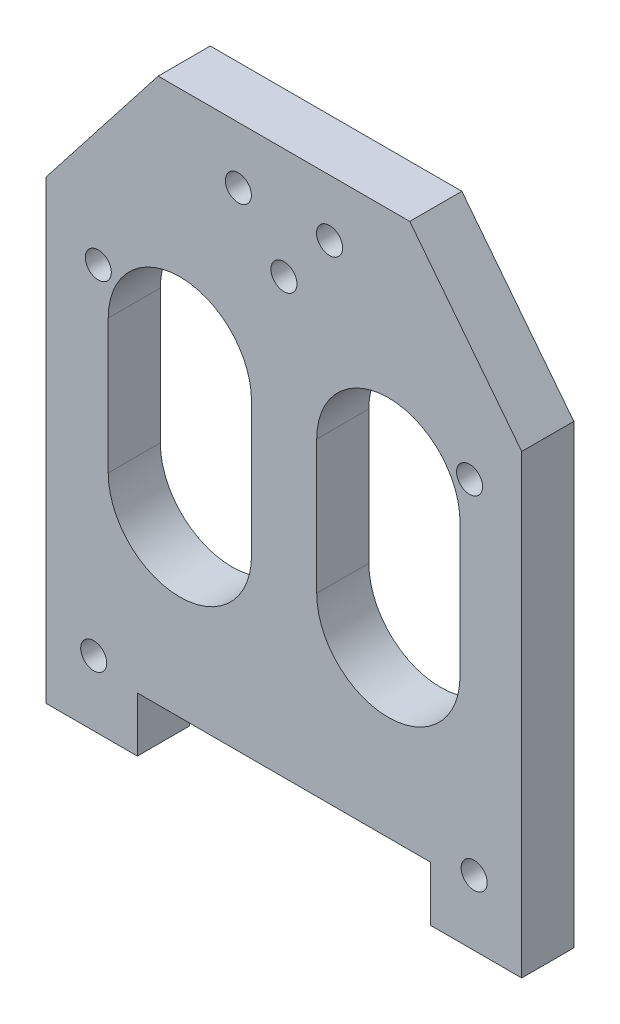
ISO-10303-21;
HEADER;
FILE_DESCRIPTION(('STEP AP214'),'2;1');
FILE_NAME('part.step','',(''),(''),'','','');
FILE_SCHEMA(('AUTOMOTIVE_DESIGN { 1 0 10303 214 1 1 1 1 }'));
ENDSEC;
DATA;
#1=APPLICATION_CONTEXT('core data for automotive mechanical design processes');
#2=APPLICATION_PROTOCOL_DEFINITION('international standard','automotive_design',2000,#1);
#3=PRODUCT_CONTEXT('',#1,'mechanical');
#4=PRODUCT('Part','Part','',(#3));
#5=PRODUCT_RELATED_PRODUCT_CATEGORY('part','',(#4));
#6=PRODUCT_DEFINITION_FORMATION('','',#4);
#7=PRODUCT_DEFINITION_CONTEXT('part definition',#1,'design');
#8=PRODUCT_DEFINITION('design','',#6,#7);
#9=PRODUCT_DEFINITION_SHAPE('','',#8);
#10=(LENGTH_UNIT() NAMED_UNIT(*) SI_UNIT(.MILLI.,.METRE.));
#11=(NAMED_UNIT(*) PLANE_ANGLE_UNIT() SI_UNIT($,.RADIAN.));
#12=(NAMED_UNIT(*) SI_UNIT($,.STERADIAN.) SOLID_ANGLE_UNIT());
#13=UNCERTAINTY_MEASURE_WITH_UNIT(LENGTH_MEASURE(1.E-05),#10,'distance_accuracy_value','');
#14=(GEOMETRIC_REPRESENTATION_CONTEXT(3) GLOBAL_UNCERTAINTY_ASSIGNED_CONTEXT((#13)) GLOBAL_UNIT_ASSIGNED_CONTEXT((#10,
#11,#12)) REPRESENTATION_CONTEXT('',''));
#15=CARTESIAN_POINT('',(0.,0.,0.));
#16=DIRECTION('',(0.,0.,1.));
#17=DIRECTION('',(1.,0.,0.));
#18=AXIS2_PLACEMENT_3D('',#15,#16,#17);
#19=CARTESIAN_POINT('',(36.5,0.,8.));
#20=DIRECTION('',(-1.,0.,0.));
#21=DIRECTION('',(0.,-1.,0.));
#22=AXIS2_PLACEMENT_3D('',#19,#20,#21);
#23=PLANE('',#22);
#24=DIRECTION('',(0.,1.,0.));
#25=VECTOR('',#24,1.);
#26=CARTESIAN_POINT('',(36.5,0.,0.));
#27=LINE('',#26,#25);
#28=CARTESIAN_POINT('',(36.5,-75.,0.));
#29=VERTEX_POINT('',#28);
#30=CARTESIAN_POINT('',(36.5,-4.99999999999991,0.));
#31=VERTEX_POINT('',#30);
#32=EDGE_CURVE('E244',#29,#31,#27,.T.);
#33=ORIENTED_EDGE('',*,*,#32,.T.);
#34=DIRECTION('',(0.,0.,-1.));
#35=VECTOR('',#34,1.);
#36=CARTESIAN_POINT('',(36.5,-4.99999999999991,8.));
#37=LINE('',#36,#35);
#38=CARTESIAN_POINT('',(36.5,-4.99999999999991,8.));
#39=VERTEX_POINT('',#38);
#40=EDGE_CURVE('E11',#39,#31,#37,.T.);
#41=ORIENTED_EDGE('',*,*,#40,.F.);
#42=DIRECTION('',(0.,1.,0.));
#43=VECTOR('',#42,1.);
#44=CARTESIAN_POINT('',(36.5,0.,8.));
#45=LINE('',#44,#43);
#46=CARTESIAN_POINT('',(36.5,-75.,8.));
#47=VERTEX_POINT('',#46);
#48=EDGE_CURVE('E406',#47,#39,#45,.T.);
#49=ORIENTED_EDGE('',*,*,#48,.F.);
#50=DIRECTION('',(0.,0.,-1.));
#51=VECTOR('',#50,1.);
#52=CARTESIAN_POINT('',(36.5,-75.,8.));
#53=LINE('',#52,#51);
#54=EDGE_CURVE('E263',#47,#29,#53,.T.);
#55=ORIENTED_EDGE('',*,*,#54,.T.);
#56=EDGE_LOOP('',(#33,#41,#49,#55));
#57=FACE_BOUND('',#56,.T.);
#58=ADVANCED_FACE('F32',(#57),#23,.F.);
#59=CARTESIAN_POINT('',(20.2393352791566,15.8127017435196,8.));
#60=DIRECTION('',(-0.788010753609288,-0.615661475322374,0.));
#61=DIRECTION('',(0.615661475322374,-0.788010753609288,0.));
#62=AXIS2_PLACEMENT_3D('',#59,#60,#61);
#63=PLANE('',#62);
#64=DIRECTION('',(-0.615661475322374,0.788010753609288,0.));
#65=VECTOR('',#64,1.);
#66=CARTESIAN_POINT('',(20.2393352791566,15.8127017435196,0.));
#67=LINE('',#66,#65);
#68=CARTESIAN_POINT('',(19.311716217,17.,0.));
#69=VERTEX_POINT('',#68);
#70=EDGE_CURVE('E247',#31,#69,#67,.T.);
#71=ORIENTED_EDGE('',*,*,#70,.T.);
#72=DIRECTION('',(0.,0.,-1.));
#73=VECTOR('',#72,1.);
#74=CARTESIAN_POINT('',(19.311716217,17.,8.));
#75=LINE('',#74,#73);
#76=CARTESIAN_POINT('',(19.311716217,17.,8.));
#77=VERTEX_POINT('',#76);
#78=EDGE_CURVE('E44',#77,#69,#75,.T.);
#79=ORIENTED_EDGE('',*,*,#78,.F.);
#80=DIRECTION('',(-0.615661475322374,0.788010753609288,0.));
#81=VECTOR('',#80,1.);
#82=CARTESIAN_POINT('',(20.2393352791566,15.8127017435196,8.));
#83=LINE('',#82,#81);
#84=EDGE_CURVE('E408',#39,#77,#83,.T.);
#85=ORIENTED_EDGE('',*,*,#84,.F.);
#86=ORIENTED_EDGE('',*,*,#40,.T.);
#87=EDGE_LOOP('',(#71,#79,#85,#86));
#88=FACE_BOUND('',#87,.T.);
#89=ADVANCED_FACE('F353',(#88),#63,.F.);
#90=CARTESIAN_POINT('',(0.,17.,8.));
#91=DIRECTION('',(0.,-1.,0.));
#92=DIRECTION('',(0.,0.,-1.));
#93=AXIS2_PLACEMENT_3D('',#90,#91,#92);
#94=PLANE('',#93);
#95=DIRECTION('',(-1.,0.,0.));
#96=VECTOR('',#95,1.);
#97=CARTESIAN_POINT('',(0.,17.,0.));
#98=LINE('',#97,#96);
#99=CARTESIAN_POINT('',(-19.311716217,17.,0.));
#100=VERTEX_POINT('',#99);
#101=EDGE_CURVE('E249',#69,#100,#98,.T.);
#102=ORIENTED_EDGE('',*,*,#101,.T.);
#103=DIRECTION('',(0.,0.,-1.));
#104=VECTOR('',#103,1.);
#105=CARTESIAN_POINT('',(-19.311716217,17.,8.));
#106=LINE('',#105,#104);
#107=CARTESIAN_POINT('',(-19.311716217,17.,8.));
#108=VERTEX_POINT('',#107);
#109=EDGE_CURVE('E277',#108,#100,#106,.T.);
#110=ORIENTED_EDGE('',*,*,#109,.F.);
#111=DIRECTION('',(-1.,0.,0.));
#112=VECTOR('',#111,1.);
#113=CARTESIAN_POINT('',(0.,17.,8.));
#114=LINE('',#113,#112);
#115=EDGE_CURVE('E410',#77,#108,#114,.T.);
#116=ORIENTED_EDGE('',*,*,#115,.F.);
#117=ORIENTED_EDGE('',*,*,#78,.T.);
#118=EDGE_LOOP('',(#102,#110,#116,#117));
#119=FACE_BOUND('',#118,.T.);
#120=ADVANCED_FACE('F359',(#119),#94,.F.);
#121=CARTESIAN_POINT('',(-20.2393352791568,15.8127017435195,8.));
#122=DIRECTION('',(0.788010753609292,-0.615661475322369,0.));
#123=DIRECTION('',(0.615661475322369,0.788010753609292,0.));
#124=AXIS2_PLACEMENT_3D('',#121,#122,#123);
#125=PLANE('',#124);
#126=DIRECTION('',(-0.615661475322369,-0.788010753609292,0.));
#127=VECTOR('',#126,1.);
#128=CARTESIAN_POINT('',(-20.2393352791568,15.8127017435195,0.));
#129=LINE('',#128,#127);
#130=CARTESIAN_POINT('',(-36.5,-5.00000000000008,0.));
#131=VERTEX_POINT('',#130);
#132=EDGE_CURVE('E251',#100,#131,#129,.T.);
#133=ORIENTED_EDGE('',*,*,#132,.T.);
#134=DIRECTION('',(0.,0.,-1.));
#135=VECTOR('',#134,1.);
#136=CARTESIAN_POINT('',(-36.5,-5.00000000000008,8.));
#137=LINE('',#136,#135);
#138=CARTESIAN_POINT('',(-36.5,-5.00000000000008,8.));
#139=VERTEX_POINT('',#138);
#140=EDGE_CURVE('E274',#139,#131,#137,.T.);
#141=ORIENTED_EDGE('',*,*,#140,.F.);
#142=DIRECTION('',(-0.615661475322369,-0.788010753609292,0.));
#143=VECTOR('',#142,1.);
#144=CARTESIAN_POINT('',(-20.2393352791568,15.8127017435195,8.));
#145=LINE('',#144,#143);
#146=EDGE_CURVE('E412',#108,#139,#145,.T.);
#147=ORIENTED_EDGE('',*,*,#146,.F.);
#148=ORIENTED_EDGE('',*,*,#109,.T.);
#149=EDGE_LOOP('',(#133,#141,#147,#148));
#150=FACE_BOUND('',#149,.T.);
#151=ADVANCED_FACE('F449',(#150),#125,.F.);
#152=CARTESIAN_POINT('',(-36.5,0.,8.));
#153=DIRECTION('',(1.,0.,0.));
#154=DIRECTION('',(0.,0.,-1.));
#155=AXIS2_PLACEMENT_3D('',#152,#153,#154);
#156=PLANE('',#155);
#157=DIRECTION('',(0.,-1.,0.));
#158=VECTOR('',#157,1.);
#159=CARTESIAN_POINT('',(-36.5,0.,0.));
#160=LINE('',#159,#158);
#161=CARTESIAN_POINT('',(-36.5,-75.,0.));
#162=VERTEX_POINT('',#161);
#163=EDGE_CURVE('E253',#131,#162,#160,.T.);
#164=ORIENTED_EDGE('',*,*,#163,.T.);
#165=DIRECTION('',(0.,0.,-1.));
#166=VECTOR('',#165,1.);
#167=CARTESIAN_POINT('',(-36.5,-75.,8.));
#168=LINE('',#167,#166);
#169=CARTESIAN_POINT('',(-36.5,-75.,8.));
#170=VERTEX_POINT('',#169);
#171=EDGE_CURVE('E271',#170,#162,#168,.T.);
#172=ORIENTED_EDGE('',*,*,#171,.F.);
#173=DIRECTION('',(0.,-1.,0.));
#174=VECTOR('',#173,1.);
#175=CARTESIAN_POINT('',(-36.5,0.,8.));
#176=LINE('',#175,#174);
#177=EDGE_CURVE('E414',#139,#170,#176,.T.);
#178=ORIENTED_EDGE('',*,*,#177,.F.);
#179=ORIENTED_EDGE('',*,*,#140,.T.);
#180=EDGE_LOOP('',(#164,#172,#178,#179));
#181=FACE_BOUND('',#180,.T.);
#182=ADVANCED_FACE('F446',(#181),#156,.F.);
#183=CARTESIAN_POINT('',(0.,-75.,8.));
#184=DIRECTION('',(0.,1.,0.));
#185=DIRECTION('',(0.,0.,1.));
#186=AXIS2_PLACEMENT_3D('',#183,#184,#185);
#187=PLANE('',#186);
#188=DIRECTION('',(1.,0.,0.));
#189=VECTOR('',#188,1.);
#190=CARTESIAN_POINT('',(0.,-75.,0.));
#191=LINE('',#190,#189);
#192=CARTESIAN_POINT('',(-22.4999999985,-75.,0.));
#193=VERTEX_POINT('',#192);
#194=EDGE_CURVE('E255',#162,#193,#191,.T.);
#195=ORIENTED_EDGE('',*,*,#194,.T.);
#196=DIRECTION('',(0.,0.,-1.));
#197=VECTOR('',#196,1.);
#198=CARTESIAN_POINT('',(-22.4999999985,-75.,8.));
#199=LINE('',#198,#197);
#200=CARTESIAN_POINT('',(-22.4999999985,-75.,8.));
#201=VERTEX_POINT('',#200);
#202=EDGE_CURVE('E268',#201,#193,#199,.T.);
#203=ORIENTED_EDGE('',*,*,#202,.F.);
#204=DIRECTION('',(1.,0.,0.));
#205=VECTOR('',#204,1.);
#206=CARTESIAN_POINT('',(0.,-75.,8.));
#207=LINE('',#206,#205);
#208=EDGE_CURVE('E416',#170,#201,#207,.T.);
#209=ORIENTED_EDGE('',*,*,#208,.F.);
#210=ORIENTED_EDGE('',*,*,#171,.T.);
#211=EDGE_LOOP('',(#195,#203,#209,#210));
#212=FACE_BOUND('',#211,.T.);
#213=ADVANCED_FACE('F422',(#212),#187,.F.);
#214=CARTESIAN_POINT('',(-22.4999999985,0.,8.));
#215=DIRECTION('',(-1.,0.,0.));
#216=DIRECTION('',(0.,0.,1.));
#217=AXIS2_PLACEMENT_3D('',#214,#215,#216);
#218=PLANE('',#217);
#219=DIRECTION('',(0.,1.,0.));
#220=VECTOR('',#219,1.);
#221=CARTESIAN_POINT('',(-22.4999999985,0.,0.));
#222=LINE('',#221,#220);
#223=CARTESIAN_POINT('',(-22.4999999985,-66.599999996,0.));
#224=VERTEX_POINT('',#223);
#225=EDGE_CURVE('E257',#193,#224,#222,.T.);
#226=ORIENTED_EDGE('',*,*,#225,.T.);
#227=DIRECTION('',(0.,0.,-1.));
#228=VECTOR('',#227,1.);
#229=CARTESIAN_POINT('',(-22.4999999985,-66.599999996,8.));
#230=LINE('',#229,#228);
#231=CARTESIAN_POINT('',(-22.4999999985,-66.599999996,8.));
#232=VERTEX_POINT('',#231);
#233=EDGE_CURVE('E186',#232,#224,#230,.T.);
#234=ORIENTED_EDGE('',*,*,#233,.F.);
#235=DIRECTION('',(0.,1.,0.));
#236=VECTOR('',#235,1.);
#237=CARTESIAN_POINT('',(-22.4999999985,0.,8.));
#238=LINE('',#237,#236);
#239=EDGE_CURVE('E177',#201,#232,#238,.T.);
#240=ORIENTED_EDGE('',*,*,#239,.F.);
#241=ORIENTED_EDGE('',*,*,#202,.T.);
#242=EDGE_LOOP('',(#226,#234,#240,#241));
#243=FACE_BOUND('',#242,.T.);
#244=ADVANCED_FACE('F426',(#243),#218,.F.);
#245=CARTESIAN_POINT('',(0.,-66.599999996,8.));
#246=DIRECTION('',(0.,1.,0.));
#247=DIRECTION('',(0.,0.,1.));
#248=AXIS2_PLACEMENT_3D('',#245,#246,#247);
#249=PLANE('',#248);
#250=DIRECTION('',(1.,0.,0.));
#251=VECTOR('',#250,1.);
#252=CARTESIAN_POINT('',(0.,-66.599999996,0.));
#253=LINE('',#252,#251);
#254=CARTESIAN_POINT('',(22.4999999985,-66.599999996,0.));
#255=VERTEX_POINT('',#254);
#256=EDGE_CURVE('E185',#224,#255,#253,.T.);
#257=ORIENTED_EDGE('',*,*,#256,.T.);
#258=DIRECTION('',(0.,0.,-1.));
#259=VECTOR('',#258,1.);
#260=CARTESIAN_POINT('',(22.4999999985,-66.599999996,8.));
#261=LINE('',#260,#259);
#262=CARTESIAN_POINT('',(22.4999999985,-66.599999996,8.));
#263=VERTEX_POINT('',#262);
#264=EDGE_CURVE('E182',#263,#255,#261,.T.);
#265=ORIENTED_EDGE('',*,*,#264,.F.);
#266=DIRECTION('',(1.,0.,0.));
#267=VECTOR('',#266,1.);
#268=CARTESIAN_POINT('',(0.,-66.599999996,8.));
#269=LINE('',#268,#267);
#270=EDGE_CURVE('E171',#232,#263,#269,.T.);
#271=ORIENTED_EDGE('',*,*,#270,.F.);
#272=ORIENTED_EDGE('',*,*,#233,.T.);
#273=EDGE_LOOP('',(#257,#265,#271,#272));
#274=FACE_BOUND('',#273,.T.);
#275=ADVANCED_FACE('F183',(#274),#249,.F.);
#276=CARTESIAN_POINT('',(22.4999999985,0.,8.));
#277=DIRECTION('',(1.,0.,0.));
#278=DIRECTION('',(0.,0.,-1.));
#279=AXIS2_PLACEMENT_3D('',#276,#277,#278);
#280=PLANE('',#279);
#281=DIRECTION('',(0.,-1.,0.));
#282=VECTOR('',#281,1.);
#283=CARTESIAN_POINT('',(22.4999999985,0.,0.));
#284=LINE('',#283,#282);
#285=CARTESIAN_POINT('',(22.4999999985,-75.,0.));
#286=VERTEX_POINT('',#285);
#287=EDGE_CURVE('E112',#255,#286,#284,.T.);
#288=ORIENTED_EDGE('',*,*,#287,.T.);
#289=DIRECTION('',(0.,0.,-1.));
#290=VECTOR('',#289,1.);
#291=CARTESIAN_POINT('',(22.4999999985,-75.,8.));
#292=LINE('',#291,#290);
#293=CARTESIAN_POINT('',(22.4999999985,-75.,8.));
#294=VERTEX_POINT('',#293);
#295=EDGE_CURVE('E187',#294,#286,#292,.T.);
#296=ORIENTED_EDGE('',*,*,#295,.F.);
#297=DIRECTION('',(0.,-1.,0.));
#298=VECTOR('',#297,1.);
#299=CARTESIAN_POINT('',(22.4999999985,0.,8.));
#300=LINE('',#299,#298);
#301=EDGE_CURVE('E175',#263,#294,#300,.T.);
#302=ORIENTED_EDGE('',*,*,#301,.F.);
#303=ORIENTED_EDGE('',*,*,#264,.T.);
#304=EDGE_LOOP('',(#288,#296,#302,#303));
#305=FACE_BOUND('',#304,.T.);
#306=ADVANCED_FACE('F189',(#305),#280,.F.);
#307=CARTESIAN_POINT('',(-15.9773726441714,-39.59107523898,8.));
#308=DIRECTION('',(0.,0.,-1.));
#309=DIRECTION('',(-1.,0.,0.));
#310=AXIS2_PLACEMENT_3D('',#307,#308,#309);
#311=CYLINDRICAL_SURFACE('',#310,10.9999941577025);
#312=CARTESIAN_POINT('',(-15.9773726441714,-39.59107523898,0.));
#313=DIRECTION('',(0.,0.,1.));
#314=DIRECTION('',(1.,0.,0.));
#315=AXIS2_PLACEMENT_3D('',#312,#313,#314);
#316=CIRCLE('',#315,10.9999941577025);
#317=CARTESIAN_POINT('',(-26.9773668018739,-39.59107523898,0.));
#318=VERTEX_POINT('',#317);
#319=CARTESIAN_POINT('',(-4.97737848646895,-39.59107523898,0.));
#320=VERTEX_POINT('',#319);
#321=EDGE_CURVE('E232',#318,#320,#316,.T.);
#322=ORIENTED_EDGE('',*,*,#321,.F.);
#323=DIRECTION('',(0.,0.,-1.));
#324=VECTOR('',#323,1.);
#325=CARTESIAN_POINT('',(-26.9773668018739,-39.59107523898,8.));
#326=LINE('',#325,#324);
#327=CARTESIAN_POINT('',(-26.9773668018739,-39.59107523898,8.));
#328=VERTEX_POINT('',#327);
#329=EDGE_CURVE('E265',#328,#318,#326,.T.);
#330=ORIENTED_EDGE('',*,*,#329,.F.);
#331=CARTESIAN_POINT('',(-15.9773726441714,-39.59107523898,8.));
#332=DIRECTION('',(0.,0.,1.));
#333=DIRECTION('',(1.,0.,0.));
#334=AXIS2_PLACEMENT_3D('',#331,#332,#333);
#335=CIRCLE('',#334,10.9999941577025);
#336=CARTESIAN_POINT('',(-4.97737848646895,-39.59107523898,8.));
#337=VERTEX_POINT('',#336);
#338=EDGE_CURVE('E396',#328,#337,#335,.T.);
#339=ORIENTED_EDGE('',*,*,#338,.T.);
#340=DIRECTION('',(0.,0.,-1.));
#341=VECTOR('',#340,1.);
#342=CARTESIAN_POINT('',(-4.97737848646895,-39.59107523898,8.));
#343=LINE('',#342,#341);
#344=EDGE_CURVE('E282',#337,#320,#343,.T.);
#345=ORIENTED_EDGE('',*,*,#344,.T.);
#346=EDGE_LOOP('',(#322,#330,#339,#345));
#347=FACE_BOUND('',#346,.T.);
#348=ADVANCED_FACE('F372',(#347),#311,.F.);
#349=CARTESIAN_POINT('',(-26.9773912037194,-1.66274445938005E-05,8.));
#350=DIRECTION('',(0.99999999999981,6.16347387641578E-07,0.));
#351=DIRECTION('',(-6.16347387641578E-07,0.99999999999981,0.));
#352=AXIS2_PLACEMENT_3D('',#349,#350,#351);
#353=PLANE('',#352);
#354=DIRECTION('',(6.16347387641578E-07,-0.99999999999981,0.));
#355=VECTOR('',#354,1.);
#356=CARTESIAN_POINT('',(-26.9773912037194,-1.66274445938005E-05,0.));
#357=LINE('',#356,#355);
#358=CARTESIAN_POINT('',(-26.9773794871606,-19.0096841131543,0.));
#359=VERTEX_POINT('',#358);
#360=EDGE_CURVE('E235',#359,#318,#357,.T.);
#361=ORIENTED_EDGE('',*,*,#360,.F.);
#362=DIRECTION('',(0.,0.,-1.));
#363=VECTOR('',#362,1.);
#364=CARTESIAN_POINT('',(-26.9773794871606,-19.0096841131543,8.));
#365=LINE('',#364,#363);
#366=CARTESIAN_POINT('',(-26.9773794871606,-19.0096841131543,8.));
#367=VERTEX_POINT('',#366);
#368=EDGE_CURVE('E286',#367,#359,#365,.T.);
#369=ORIENTED_EDGE('',*,*,#368,.F.);
#370=DIRECTION('',(6.16347387641578E-07,-0.99999999999981,0.));
#371=VECTOR('',#370,1.);
#372=CARTESIAN_POINT('',(-26.9773912037194,-1.66274445938005E-05,8.));
#373=LINE('',#372,#371);
#374=EDGE_CURVE('E391',#367,#328,#373,.T.);
#375=ORIENTED_EDGE('',*,*,#374,.T.);
#376=ORIENTED_EDGE('',*,*,#329,.T.);
#377=EDGE_LOOP('',(#361,#369,#375,#376));
#378=FACE_BOUND('',#377,.T.);
#379=ADVANCED_FACE('F369',(#378),#353,.T.);
#380=CARTESIAN_POINT('',(-15.9773853294581,-19.0096841131543,8.));
#381=DIRECTION('',(0.,0.,-1.));
#382=DIRECTION('',(-1.,0.,0.));
#383=AXIS2_PLACEMENT_3D('',#380,#381,#382);
#384=CYLINDRICAL_SURFACE('',#383,10.9999941577025);
#385=CARTESIAN_POINT('',(-15.9773853294581,-19.0096841131543,0.));
#386=DIRECTION('',(0.,0.,1.));
#387=DIRECTION('',(1.,0.,0.));
#388=AXIS2_PLACEMENT_3D('',#385,#386,#387);
#389=CIRCLE('',#388,10.9999941577025);
#390=CARTESIAN_POINT('',(-4.97739117175564,-19.0096841131543,0.));
#391=VERTEX_POINT('',#390);
#392=EDGE_CURVE('E238',#391,#359,#389,.T.);
#393=ORIENTED_EDGE('',*,*,#392,.F.);
#394=DIRECTION('',(0.,0.,-1.));
#395=VECTOR('',#394,1.);
#396=CARTESIAN_POINT('',(-4.97739117175564,-19.0096841131543,8.));
#397=LINE('',#396,#395);
#398=CARTESIAN_POINT('',(-4.97739117175564,-19.0096841131543,8.));
#399=VERTEX_POINT('',#398);
#400=EDGE_CURVE('E284',#399,#391,#397,.T.);
#401=ORIENTED_EDGE('',*,*,#400,.F.);
#402=CARTESIAN_POINT('',(-15.9773853294581,-19.0096841131543,8.));
#403=DIRECTION('',(0.,0.,1.));
#404=DIRECTION('',(1.,0.,0.));
#405=AXIS2_PLACEMENT_3D('',#402,#403,#404);
#406=CIRCLE('',#405,10.9999941577025);
#407=EDGE_CURVE('E395',#399,#367,#406,.T.);
#408=ORIENTED_EDGE('',*,*,#407,.T.);
#409=ORIENTED_EDGE('',*,*,#368,.T.);
#410=EDGE_LOOP('',(#393,#401,#408,#409));
#411=FACE_BOUND('',#410,.T.);
#412=ADVANCED_FACE('F322',(#411),#384,.F.);
#413=CARTESIAN_POINT('',(16.0301881892566,-39.59107523898,8.));
#414=DIRECTION('',(0.,0.,-1.));
#415=DIRECTION('',(-1.,0.,0.));
#416=AXIS2_PLACEMENT_3D('',#413,#414,#415);
#417=CYLINDRICAL_SURFACE('',#416,10.9999943945777);
#418=CARTESIAN_POINT('',(16.0301881892566,-39.59107523898,0.));
#419=DIRECTION('',(0.,0.,1.));
#420=DIRECTION('',(1.,0.,0.));
#421=AXIS2_PLACEMENT_3D('',#418,#419,#420);
#422=CIRCLE('',#421,10.9999943945777);
#423=CARTESIAN_POINT('',(5.03019379467892,-39.59107523898,0.));
#424=VERTEX_POINT('',#423);
#425=CARTESIAN_POINT('',(27.0301825838343,-39.59107523898,0.));
#426=VERTEX_POINT('',#425);
#427=EDGE_CURVE('E216',#424,#426,#422,.T.);
#428=ORIENTED_EDGE('',*,*,#427,.F.);
#429=DIRECTION('',(0.,0.,-1.));
#430=VECTOR('',#429,1.);
#431=CARTESIAN_POINT('',(5.03019379467892,-39.59107523898,8.));
#432=LINE('',#431,#430);
#433=CARTESIAN_POINT('',(5.03019379467892,-39.59107523898,8.));
#434=VERTEX_POINT('',#433);
#435=EDGE_CURVE('E126',#434,#424,#432,.T.);
#436=ORIENTED_EDGE('',*,*,#435,.F.);
#437=CARTESIAN_POINT('',(16.0301881892566,-39.59107523898,8.));
#438=DIRECTION('',(0.,0.,1.));
#439=DIRECTION('',(1.,0.,0.));
#440=AXIS2_PLACEMENT_3D('',#437,#438,#439);
#441=CIRCLE('',#440,10.9999943945777);
#442=CARTESIAN_POINT('',(27.0301825838343,-39.59107523898,8.));
#443=VERTEX_POINT('',#442);
#444=EDGE_CURVE('E616',#434,#443,#441,.T.);
#445=ORIENTED_EDGE('',*,*,#444,.T.);
#446=DIRECTION('',(0.,0.,-1.));
#447=VECTOR('',#446,1.);
#448=CARTESIAN_POINT('',(27.0301825838343,-39.59107523898,8.));
#449=LINE('',#448,#447);
#450=EDGE_CURVE('E191',#443,#426,#449,.T.);
#451=ORIENTED_EDGE('',*,*,#450,.T.);
#452=EDGE_LOOP('',(#428,#436,#445,#451));
#453=FACE_BOUND('',#452,.T.);
#454=ADVANCED_FACE('F318',(#453),#417,.F.);
#455=CARTESIAN_POINT('',(5.03016912422898,3.13445707156947E-06,8.));
#456=DIRECTION('',(0.999999999999806,6.23131547699067E-07,0.));
#457=DIRECTION('',(-6.23131547699067E-07,0.999999999999806,0.));
#458=AXIS2_PLACEMENT_3D('',#455,#456,#457);
#459=PLANE('',#458);
#460=DIRECTION('',(6.23131547699067E-07,-0.999999999999806,0.));
#461=VECTOR('',#460,1.);
#462=CARTESIAN_POINT('',(5.03016912422898,3.13445707156947E-06,0.));
#463=LINE('',#462,#461);
#464=CARTESIAN_POINT('',(5.0301810182636,-19.0875148493323,0.));
#465=VERTEX_POINT('',#464);
#466=EDGE_CURVE('E219',#465,#424,#463,.T.);
#467=ORIENTED_EDGE('',*,*,#466,.F.);
#468=CARTESIAN_POINT('',(5.03018101826146,-19.0875148493323,8.));
#469=DIRECTION('',(0.,0.,-1.));
#470=VECTOR('',#469,1.);
#471=LINE('',#468,#470);
#472=CARTESIAN_POINT('',(5.0301810182636,-19.0875148493323,8.));
#473=VERTEX_POINT('',#472);
#474=EDGE_CURVE('E292',#473,#465,#471,.T.);
#475=ORIENTED_EDGE('',*,*,#474,.F.);
#476=DIRECTION('',(6.23131547699067E-07,-0.999999999999806,0.));
#477=VECTOR('',#476,1.);
#478=CARTESIAN_POINT('',(5.03016912422898,3.13445707156947E-06,8.));
#479=LINE('',#478,#477);
#480=EDGE_CURVE('E622',#473,#434,#479,.T.);
#481=ORIENTED_EDGE('',*,*,#480,.T.);
#482=ORIENTED_EDGE('',*,*,#435,.T.);
#483=EDGE_LOOP('',(#467,#475,#481,#482));
#484=FACE_BOUND('',#483,.T.);
#485=ADVANCED_FACE('F312',(#484),#459,.T.);
#486=CARTESIAN_POINT('',(16.030175412837,-19.0875079940277,8.));
#487=DIRECTION('',(0.,0.,-1.));
#488=DIRECTION('',(-1.,0.,0.));
#489=AXIS2_PLACEMENT_3D('',#486,#487,#488);
#490=CYLINDRICAL_SURFACE('',#489,10.9999943945777);
#491=CARTESIAN_POINT('',(16.030175412837,-19.0875079940277,0.));
#492=DIRECTION('',(0.,0.,1.));
#493=DIRECTION('',(1.,0.,0.));
#494=AXIS2_PLACEMENT_3D('',#491,#492,#493);
#495=CIRCLE('',#494,10.9999943945777);
#496=CARTESIAN_POINT('',(27.0301698074147,-19.0875079940277,0.));
#497=VERTEX_POINT('',#496);
#498=EDGE_CURVE('E222',#497,#465,#495,.T.);
#499=ORIENTED_EDGE('',*,*,#498,.F.);
#500=DIRECTION('',(0.,0.,-1.));
#501=VECTOR('',#500,1.);
#502=CARTESIAN_POINT('',(27.0301698074147,-19.0875079940277,8.));
#503=LINE('',#502,#501);
#504=CARTESIAN_POINT('',(27.0301698074147,-19.0875079940277,8.));
#505=VERTEX_POINT('',#504);
#506=EDGE_CURVE('E290',#505,#497,#503,.T.);
#507=ORIENTED_EDGE('',*,*,#506,.F.);
#508=CARTESIAN_POINT('',(16.030175412837,-19.0875079940277,8.));
#509=DIRECTION('',(0.,0.,1.));
#510=DIRECTION('',(1.,0.,0.));
#511=AXIS2_PLACEMENT_3D('',#508,#509,#510);
#512=CIRCLE('',#511,10.9999943945777);
#513=EDGE_CURVE('E619',#505,#473,#512,.T.);
#514=ORIENTED_EDGE('',*,*,#513,.T.);
#515=ORIENTED_EDGE('',*,*,#474,.T.);
#516=EDGE_LOOP('',(#499,#507,#514,#515));
#517=FACE_BOUND('',#516,.T.);
#518=ADVANCED_FACE('F302',(#517),#490,.F.);
#519=CARTESIAN_POINT('',(-4.97740288832291,-3.06780927417046E-06,8.));
#520=DIRECTION('',(-0.99999999999981,-6.16347388990155E-07,0.));
#521=DIRECTION('',(6.16347388990155E-07,-0.99999999999981,0.));
#522=AXIS2_PLACEMENT_3D('',#519,#520,#521);
#523=PLANE('',#522);
#524=DIRECTION('',(-6.16347388990155E-07,0.99999999999981,0.));
#525=VECTOR('',#524,1.);
#526=CARTESIAN_POINT('',(-4.97740288832291,-3.06780927417046E-06,0.));
#527=LINE('',#526,#525);
#528=EDGE_CURVE('E241',#320,#391,#527,.T.);
#529=ORIENTED_EDGE('',*,*,#528,.F.);
#530=ORIENTED_EDGE('',*,*,#344,.F.);
#531=DIRECTION('',(-6.16347388990155E-07,0.99999999999981,0.));
#532=VECTOR('',#531,1.);
#533=CARTESIAN_POINT('',(-4.97740288832291,-3.06780927417046E-06,8.));
#534=LINE('',#533,#532);
#535=EDGE_CURVE('E398',#337,#399,#534,.T.);
#536=ORIENTED_EDGE('',*,*,#535,.T.);
#537=ORIENTED_EDGE('',*,*,#400,.T.);
#538=EDGE_LOOP('',(#529,#530,#536,#537));
#539=FACE_BOUND('',#538,.T.);
#540=ADVANCED_FACE('F311',(#539),#523,.T.);
#541=CARTESIAN_POINT('',(27.0301579133758,1.6843344169419E-05,8.));
#542=DIRECTION('',(0.999999999999806,6.23131548968156E-07,0.));
#543=DIRECTION('',(-6.23131548968156E-07,0.999999999999806,0.));
#544=AXIS2_PLACEMENT_3D('',#541,#542,#543);
#545=PLANE('',#544);
#546=DIRECTION('',(6.23131548968156E-07,-0.999999999999806,0.));
#547=VECTOR('',#546,1.);
#548=CARTESIAN_POINT('',(27.0301579133758,1.6843344169419E-05,0.));
#549=LINE('',#548,#547);
#550=EDGE_CURVE('E227',#497,#426,#549,.T.);
#551=ORIENTED_EDGE('',*,*,#550,.T.);
#552=ORIENTED_EDGE('',*,*,#450,.F.);
#553=DIRECTION('',(6.23131548968156E-07,-0.999999999999806,0.));
#554=VECTOR('',#553,1.);
#555=CARTESIAN_POINT('',(27.0301579133758,1.6843344169419E-05,8.));
#556=LINE('',#555,#554);
#557=EDGE_CURVE('E400',#505,#443,#556,.T.);
#558=ORIENTED_EDGE('',*,*,#557,.F.);
#559=ORIENTED_EDGE('',*,*,#506,.T.);
#560=EDGE_LOOP('',(#551,#552,#558,#559));
#561=FACE_BOUND('',#560,.T.);
#562=ADVANCED_FACE('F313',(#561),#545,.F.);
#563=CARTESIAN_POINT('',(0.,0.,8.));
#564=DIRECTION('',(0.,0.,-1.));
#565=DIRECTION('',(-1.,0.,0.));
#566=AXIS2_PLACEMENT_3D('',#563,#564,#565);
#567=CYLINDRICAL_SURFACE('',#566,1.99999999999999);
#568=CARTESIAN_POINT('',(0.,0.,8.));
#569=DIRECTION('',(0.,0.,1.));
#570=DIRECTION('',(1.,0.,0.));
#571=AXIS2_PLACEMENT_3D('',#568,#569,#570);
#572=CIRCLE('',#571,1.99999999999999);
#573=CARTESIAN_POINT('',(1.99999999999999,0.,8.));
#574=VERTEX_POINT('',#573);
#575=EDGE_CURVE('E632',#574,#574,#572,.T.);
#576=ORIENTED_EDGE('',*,*,#575,.T.);
#577=EDGE_LOOP('',(#576));
#578=FACE_BOUND('',#577,.T.);
#579=CARTESIAN_POINT('',(0.,0.,0.));
#580=DIRECTION('',(0.,0.,1.));
#581=DIRECTION('',(1.,0.,0.));
#582=AXIS2_PLACEMENT_3D('',#579,#580,#581);
#583=CIRCLE('',#582,1.99999999999999);
#584=CARTESIAN_POINT('',(1.99999999999999,0.,0.));
#585=VERTEX_POINT('',#584);
#586=EDGE_CURVE('E213',#585,#585,#583,.T.);
#587=ORIENTED_EDGE('',*,*,#586,.F.);
#588=EDGE_LOOP('',(#587));
#589=FACE_BOUND('',#588,.T.);
#590=ADVANCED_FACE('F323',(#578,#589),#567,.F.);
#591=CARTESIAN_POINT('',(-7.,8.3,8.));
#592=DIRECTION('',(0.,0.,-1.));
#593=DIRECTION('',(-1.,0.,0.));
#594=AXIS2_PLACEMENT_3D('',#591,#592,#593);
#595=CYLINDRICAL_SURFACE('',#594,1.99999999999999);
#596=CARTESIAN_POINT('',(-7.,8.3,8.));
#597=DIRECTION('',(0.,0.,1.));
#598=DIRECTION('',(1.,0.,0.));
#599=AXIS2_PLACEMENT_3D('',#596,#597,#598);
#600=CIRCLE('',#599,1.99999999999999);
#601=CARTESIAN_POINT('',(-5.00000000000001,8.3,8.));
#602=VERTEX_POINT('',#601);
#603=EDGE_CURVE('E635',#602,#602,#600,.T.);
#604=ORIENTED_EDGE('',*,*,#603,.T.);
#605=EDGE_LOOP('',(#604));
#606=FACE_BOUND('',#605,.T.);
#607=CARTESIAN_POINT('',(-7.,8.3,0.));
#608=DIRECTION('',(0.,0.,1.));
#609=DIRECTION('',(1.,0.,0.));
#610=AXIS2_PLACEMENT_3D('',#607,#608,#609);
#611=CIRCLE('',#610,1.99999999999999);
#612=CARTESIAN_POINT('',(-5.00000000000001,8.3,0.));
#613=VERTEX_POINT('',#612);
#614=EDGE_CURVE('E210',#613,#613,#611,.T.);
#615=ORIENTED_EDGE('',*,*,#614,.F.);
#616=EDGE_LOOP('',(#615));
#617=FACE_BOUND('',#616,.T.);
#618=ADVANCED_FACE('F326',(#606,#617),#595,.F.);
#619=CARTESIAN_POINT('',(7.,8.3,8.));
#620=DIRECTION('',(0.,0.,-1.));
#621=DIRECTION('',(-1.,0.,0.));
#622=AXIS2_PLACEMENT_3D('',#619,#620,#621);
#623=CYLINDRICAL_SURFACE('',#622,1.99999999999999);
#624=CARTESIAN_POINT('',(7.,8.3,8.));
#625=DIRECTION('',(0.,0.,1.));
#626=DIRECTION('',(1.,0.,0.));
#627=AXIS2_PLACEMENT_3D('',#624,#625,#626);
#628=CIRCLE('',#627,1.99999999999999);
#629=CARTESIAN_POINT('',(8.99999999999999,8.3,8.));
#630=VERTEX_POINT('',#629);
#631=EDGE_CURVE('E638',#630,#630,#628,.T.);
#632=ORIENTED_EDGE('',*,*,#631,.T.);
#633=EDGE_LOOP('',(#632));
#634=FACE_BOUND('',#633,.T.);
#635=CARTESIAN_POINT('',(7.,8.3,0.));
#636=DIRECTION('',(0.,0.,1.));
#637=DIRECTION('',(1.,0.,0.));
#638=AXIS2_PLACEMENT_3D('',#635,#636,#637);
#639=CIRCLE('',#638,1.99999999999999);
#640=CARTESIAN_POINT('',(8.99999999999999,8.3,0.));
#641=VERTEX_POINT('',#640);
#642=EDGE_CURVE('E207',#641,#641,#639,.T.);
#643=ORIENTED_EDGE('',*,*,#642,.F.);
#644=EDGE_LOOP('',(#643));
#645=FACE_BOUND('',#644,.T.);
#646=ADVANCED_FACE('F330',(#634,#645),#623,.F.);
#647=CARTESIAN_POINT('',(-28.5,-12.7,8.));
#648=DIRECTION('',(0.,0.,-1.));
#649=DIRECTION('',(-1.,0.,0.));
#650=AXIS2_PLACEMENT_3D('',#647,#648,#649);
#651=CYLINDRICAL_SURFACE('',#650,1.99999999999998);
#652=CARTESIAN_POINT('',(-28.5,-12.7,8.));
#653=DIRECTION('',(0.,0.,1.));
#654=DIRECTION('',(1.,0.,0.));
#655=AXIS2_PLACEMENT_3D('',#652,#653,#654);
#656=CIRCLE('',#655,1.99999999999998);
#657=CARTESIAN_POINT('',(-26.5,-12.7,8.));
#658=VERTEX_POINT('',#657);
#659=EDGE_CURVE('E641',#658,#658,#656,.T.);
#660=ORIENTED_EDGE('',*,*,#659,.T.);
#661=EDGE_LOOP('',(#660));
#662=FACE_BOUND('',#661,.T.);
#663=CARTESIAN_POINT('',(-28.5,-12.7,0.));
#664=DIRECTION('',(0.,0.,1.));
#665=DIRECTION('',(1.,0.,0.));
#666=AXIS2_PLACEMENT_3D('',#663,#664,#665);
#667=CIRCLE('',#666,1.99999999999998);
#668=CARTESIAN_POINT('',(-26.5,-12.7,0.));
#669=VERTEX_POINT('',#668);
#670=EDGE_CURVE('E204',#669,#669,#667,.T.);
#671=ORIENTED_EDGE('',*,*,#670,.F.);
#672=EDGE_LOOP('',(#671));
#673=FACE_BOUND('',#672,.T.);
#674=ADVANCED_FACE('F334',(#662,#673),#651,.F.);
#675=CARTESIAN_POINT('',(-29.2,-65.,8.));
#676=DIRECTION('',(0.,0.,-1.));
#677=DIRECTION('',(-1.,0.,0.));
#678=AXIS2_PLACEMENT_3D('',#675,#676,#677);
#679=CYLINDRICAL_SURFACE('',#678,1.99999999999998);
#680=CARTESIAN_POINT('',(-29.2,-65.,8.));
#681=DIRECTION('',(0.,0.,1.));
#682=DIRECTION('',(1.,0.,0.));
#683=AXIS2_PLACEMENT_3D('',#680,#681,#682);
#684=CIRCLE('',#683,1.99999999999998);
#685=CARTESIAN_POINT('',(-27.2,-65.,8.));
#686=VERTEX_POINT('',#685);
#687=EDGE_CURVE('E644',#686,#686,#684,.T.);
#688=ORIENTED_EDGE('',*,*,#687,.T.);
#689=EDGE_LOOP('',(#688));
#690=FACE_BOUND('',#689,.T.);
#691=CARTESIAN_POINT('',(-29.2,-65.,0.));
#692=DIRECTION('',(0.,0.,1.));
#693=DIRECTION('',(1.,0.,0.));
#694=AXIS2_PLACEMENT_3D('',#691,#692,#693);
#695=CIRCLE('',#694,1.99999999999998);
#696=CARTESIAN_POINT('',(-27.2,-65.,0.));
#697=VERTEX_POINT('',#696);
#698=EDGE_CURVE('E201',#697,#697,#695,.T.);
#699=ORIENTED_EDGE('',*,*,#698,.F.);
#700=EDGE_LOOP('',(#699));
#701=FACE_BOUND('',#700,.T.);
#702=ADVANCED_FACE('F338',(#690,#701),#679,.F.);
#703=CARTESIAN_POINT('',(29.2,-65.,8.));
#704=DIRECTION('',(0.,0.,-1.));
#705=DIRECTION('',(-1.,0.,0.));
#706=AXIS2_PLACEMENT_3D('',#703,#704,#705);
#707=CYLINDRICAL_SURFACE('',#706,1.99999999999998);
#708=CARTESIAN_POINT('',(29.2,-65.,8.));
#709=DIRECTION('',(0.,0.,1.));
#710=DIRECTION('',(1.,0.,0.));
#711=AXIS2_PLACEMENT_3D('',#708,#709,#710);
#712=CIRCLE('',#711,1.99999999999998);
#713=CARTESIAN_POINT('',(31.2,-65.,8.));
#714=VERTEX_POINT('',#713);
#715=EDGE_CURVE('E647',#714,#714,#712,.T.);
#716=ORIENTED_EDGE('',*,*,#715,.T.);
#717=EDGE_LOOP('',(#716));
#718=FACE_BOUND('',#717,.T.);
#719=CARTESIAN_POINT('',(29.2,-65.,0.));
#720=DIRECTION('',(0.,0.,1.));
#721=DIRECTION('',(1.,0.,0.));
#722=AXIS2_PLACEMENT_3D('',#719,#720,#721);
#723=CIRCLE('',#722,1.99999999999998);
#724=CARTESIAN_POINT('',(31.2,-65.,0.));
#725=VERTEX_POINT('',#724);
#726=EDGE_CURVE('E198',#725,#725,#723,.T.);
#727=ORIENTED_EDGE('',*,*,#726,.F.);
#728=EDGE_LOOP('',(#727));
#729=FACE_BOUND('',#728,.T.);
#730=ADVANCED_FACE('F341',(#718,#729),#707,.F.);
#731=CARTESIAN_POINT('',(28.5,-12.7,8.));
#732=DIRECTION('',(0.,0.,-1.));
#733=DIRECTION('',(-1.,0.,0.));
#734=AXIS2_PLACEMENT_3D('',#731,#732,#733);
#735=CYLINDRICAL_SURFACE('',#734,1.99999999999999);
#736=CARTESIAN_POINT('',(28.5,-12.7,8.));
#737=DIRECTION('',(0.,0.,1.));
#738=DIRECTION('',(1.,0.,0.));
#739=AXIS2_PLACEMENT_3D('',#736,#737,#738);
#740=CIRCLE('',#739,1.99999999999999);
#741=CARTESIAN_POINT('',(30.5,-12.7,8.));
#742=VERTEX_POINT('',#741);
#743=EDGE_CURVE('E262',#742,#742,#740,.T.);
#744=ORIENTED_EDGE('',*,*,#743,.T.);
#745=EDGE_LOOP('',(#744));
#746=FACE_BOUND('',#745,.T.);
#747=CARTESIAN_POINT('',(28.5,-12.7,0.));
#748=DIRECTION('',(0.,0.,1.));
#749=DIRECTION('',(1.,0.,0.));
#750=AXIS2_PLACEMENT_3D('',#747,#748,#749);
#751=CIRCLE('',#750,1.99999999999999);
#752=CARTESIAN_POINT('',(30.5,-12.7,0.));
#753=VERTEX_POINT('',#752);
#754=EDGE_CURVE('E195',#753,#753,#751,.T.);
#755=ORIENTED_EDGE('',*,*,#754,.F.);
#756=EDGE_LOOP('',(#755));
#757=FACE_BOUND('',#756,.T.);
#758=ADVANCED_FACE('F34',(#746,#757),#735,.F.);
#759=CARTESIAN_POINT('',(0.,-75.,8.));
#760=DIRECTION('',(0.,1.,0.));
#761=DIRECTION('',(0.,0.,1.));
#762=AXIS2_PLACEMENT_3D('',#759,#760,#761);
#763=PLANE('',#762);
#764=DIRECTION('',(1.,0.,0.));
#765=VECTOR('',#764,1.);
#766=CARTESIAN_POINT('',(0.,-75.,0.));
#767=LINE('',#766,#765);
#768=EDGE_CURVE('E118',#286,#29,#767,.T.);
#769=ORIENTED_EDGE('',*,*,#768,.T.);
#770=ORIENTED_EDGE('',*,*,#54,.F.);
#771=DIRECTION('',(1.,0.,0.));
#772=VECTOR('',#771,1.);
#773=CARTESIAN_POINT('',(0.,-75.,8.));
#774=LINE('',#773,#772);
#775=EDGE_CURVE('E53',#294,#47,#774,.T.);
#776=ORIENTED_EDGE('',*,*,#775,.F.);
#777=ORIENTED_EDGE('',*,*,#295,.T.);
#778=EDGE_LOOP('',(#769,#770,#776,#777));
#779=FACE_BOUND('',#778,.T.);
#780=ADVANCED_FACE('F348',(#779),#763,.F.);
#781=CARTESIAN_POINT('',(0.,0.,8.));
#782=DIRECTION('',(0.,0.,1.));
#783=DIRECTION('',(1.,0.,0.));
#784=AXIS2_PLACEMENT_3D('',#781,#782,#783);
#785=PLANE('',#784);
#786=ORIENTED_EDGE('',*,*,#743,.F.);
#787=EDGE_LOOP('',(#786));
#788=FACE_BOUND('',#787,.T.);
#789=ORIENTED_EDGE('',*,*,#715,.F.);
#790=EDGE_LOOP('',(#789));
#791=FACE_BOUND('',#790,.T.);
#792=ORIENTED_EDGE('',*,*,#687,.F.);
#793=EDGE_LOOP('',(#792));
#794=FACE_BOUND('',#793,.T.);
#795=ORIENTED_EDGE('',*,*,#659,.F.);
#796=EDGE_LOOP('',(#795));
#797=FACE_BOUND('',#796,.T.);
#798=ORIENTED_EDGE('',*,*,#631,.F.);
#799=EDGE_LOOP('',(#798));
#800=FACE_BOUND('',#799,.T.);
#801=ORIENTED_EDGE('',*,*,#603,.F.);
#802=EDGE_LOOP('',(#801));
#803=FACE_BOUND('',#802,.T.);
#804=ORIENTED_EDGE('',*,*,#575,.F.);
#805=EDGE_LOOP('',(#804));
#806=FACE_BOUND('',#805,.T.);
#807=ORIENTED_EDGE('',*,*,#444,.F.);
#808=ORIENTED_EDGE('',*,*,#480,.F.);
#809=ORIENTED_EDGE('',*,*,#513,.F.);
#810=ORIENTED_EDGE('',*,*,#557,.T.);
#811=EDGE_LOOP('',(#807,#808,#809,#810));
#812=FACE_BOUND('',#811,.T.);
#813=ORIENTED_EDGE('',*,*,#338,.F.);
#814=ORIENTED_EDGE('',*,*,#374,.F.);
#815=ORIENTED_EDGE('',*,*,#407,.F.);
#816=ORIENTED_EDGE('',*,*,#535,.F.);
#817=EDGE_LOOP('',(#813,#814,#815,#816));
#818=FACE_BOUND('',#817,.T.);
#819=ORIENTED_EDGE('',*,*,#48,.T.);
#820=ORIENTED_EDGE('',*,*,#84,.T.);
#821=ORIENTED_EDGE('',*,*,#115,.T.);
#822=ORIENTED_EDGE('',*,*,#146,.T.);
#823=ORIENTED_EDGE('',*,*,#177,.T.);
#824=ORIENTED_EDGE('',*,*,#208,.T.);
#825=ORIENTED_EDGE('',*,*,#239,.T.);
#826=ORIENTED_EDGE('',*,*,#270,.T.);
#827=ORIENTED_EDGE('',*,*,#301,.T.);
#828=ORIENTED_EDGE('',*,*,#775,.T.);
#829=EDGE_LOOP('',(#819,#820,#821,#822,#823,#824,#825,#826,#827,#828));
#830=FACE_BOUND('',#829,.T.);
#831=ADVANCED_FACE('F173',(#788,#791,#794,#797,#800,#803,#806,#812,#818,#830),#785,.T.);
#832=CARTESIAN_POINT('',(0.,0.,0.));
#833=DIRECTION('',(0.,0.,1.));
#834=DIRECTION('',(1.,0.,0.));
#835=AXIS2_PLACEMENT_3D('',#832,#833,#834);
#836=PLANE('',#835);
#837=ORIENTED_EDGE('',*,*,#754,.T.);
#838=EDGE_LOOP('',(#837));
#839=FACE_BOUND('',#838,.T.);
#840=ORIENTED_EDGE('',*,*,#726,.T.);
#841=EDGE_LOOP('',(#840));
#842=FACE_BOUND('',#841,.T.);
#843=ORIENTED_EDGE('',*,*,#698,.T.);
#844=EDGE_LOOP('',(#843));
#845=FACE_BOUND('',#844,.T.);
#846=ORIENTED_EDGE('',*,*,#670,.T.);
#847=EDGE_LOOP('',(#846));
#848=FACE_BOUND('',#847,.T.);
#849=ORIENTED_EDGE('',*,*,#642,.T.);
#850=EDGE_LOOP('',(#849));
#851=FACE_BOUND('',#850,.T.);
#852=ORIENTED_EDGE('',*,*,#614,.T.);
#853=EDGE_LOOP('',(#852));
#854=FACE_BOUND('',#853,.T.);
#855=ORIENTED_EDGE('',*,*,#586,.T.);
#856=EDGE_LOOP('',(#855));
#857=FACE_BOUND('',#856,.T.);
#858=ORIENTED_EDGE('',*,*,#427,.T.);
#859=ORIENTED_EDGE('',*,*,#550,.F.);
#860=ORIENTED_EDGE('',*,*,#498,.T.);
#861=ORIENTED_EDGE('',*,*,#466,.T.);
#862=EDGE_LOOP('',(#858,#859,#860,#861));
#863=FACE_BOUND('',#862,.T.);
#864=ORIENTED_EDGE('',*,*,#321,.T.);
#865=ORIENTED_EDGE('',*,*,#528,.T.);
#866=ORIENTED_EDGE('',*,*,#392,.T.);
#867=ORIENTED_EDGE('',*,*,#360,.T.);
#868=EDGE_LOOP('',(#864,#865,#866,#867));
#869=FACE_BOUND('',#868,.T.);
#870=ORIENTED_EDGE('',*,*,#32,.F.);
#871=ORIENTED_EDGE('',*,*,#768,.F.);
#872=ORIENTED_EDGE('',*,*,#287,.F.);
#873=ORIENTED_EDGE('',*,*,#256,.F.);
#874=ORIENTED_EDGE('',*,*,#225,.F.);
#875=ORIENTED_EDGE('',*,*,#194,.F.);
#876=ORIENTED_EDGE('',*,*,#163,.F.);
#877=ORIENTED_EDGE('',*,*,#132,.F.);
#878=ORIENTED_EDGE('',*,*,#101,.F.);
#879=ORIENTED_EDGE('',*,*,#70,.F.);
#880=EDGE_LOOP('',(#870,#871,#872,#873,#874,#875,#876,#877,#878,#879));
#881=FACE_BOUND('',#880,.T.);
#882=ADVANCED_FACE('F386',(#839,#842,#845,#848,#851,#854,#857,#863,#869,#881),#836,.F.);
#883=CLOSED_SHELL('',(#58,#89,#120,#151,#182,#213,#244,#275,#306,#348,#379,#412,#454,#485,#518,
#540,#562,#590,#618,#646,#674,#702,#730,#758,#780,#831,#882));
#884=MANIFOLD_SOLID_BREP('B2',#883);
#885=ADVANCED_BREP_SHAPE_REPRESENTATION('',(#18,#884),#14);
#886=SHAPE_DEFINITION_REPRESENTATION(#9,#885);
ENDSEC;
END-ISO-10303-21;
